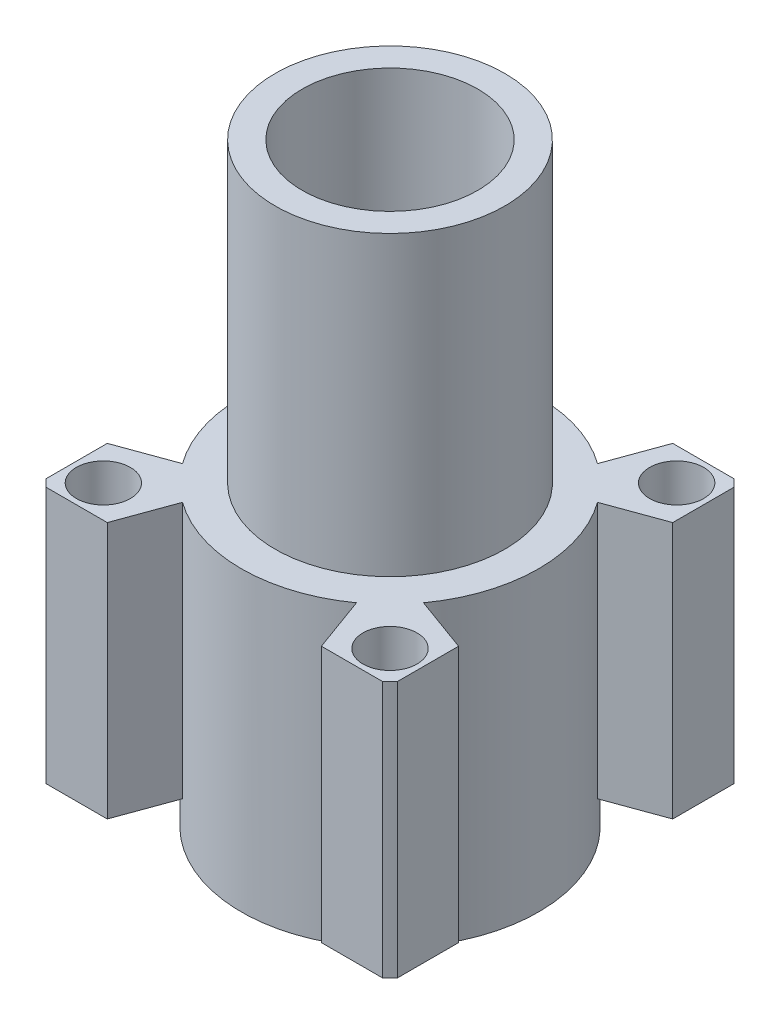
ISO-10303-21;
HEADER;
FILE_DESCRIPTION(('STEP AP214'),'2;1');
FILE_NAME('part.step','',(''),(''),'','','');
FILE_SCHEMA(('AUTOMOTIVE_DESIGN { 1 0 10303 214 1 1 1 1 }'));
ENDSEC;
DATA;
#1=APPLICATION_CONTEXT('core data for automotive mechanical design processes');
#2=APPLICATION_PROTOCOL_DEFINITION('international standard','automotive_design',2000,#1);
#3=PRODUCT_CONTEXT('',#1,'mechanical');
#4=PRODUCT('Part','Part','',(#3));
#5=PRODUCT_RELATED_PRODUCT_CATEGORY('part','',(#4));
#6=PRODUCT_DEFINITION_FORMATION('','',#4);
#7=PRODUCT_DEFINITION_CONTEXT('part definition',#1,'design');
#8=PRODUCT_DEFINITION('design','',#6,#7);
#9=PRODUCT_DEFINITION_SHAPE('','',#8);
#10=(LENGTH_UNIT() NAMED_UNIT(*) SI_UNIT(.MILLI.,.METRE.));
#11=(NAMED_UNIT(*) PLANE_ANGLE_UNIT() SI_UNIT($,.RADIAN.));
#12=(NAMED_UNIT(*) SI_UNIT($,.STERADIAN.) SOLID_ANGLE_UNIT());
#13=UNCERTAINTY_MEASURE_WITH_UNIT(LENGTH_MEASURE(1.E-05),#10,'distance_accuracy_value','');
#14=(GEOMETRIC_REPRESENTATION_CONTEXT(3) GLOBAL_UNCERTAINTY_ASSIGNED_CONTEXT((#13)) GLOBAL_UNIT_ASSIGNED_CONTEXT((#10,
#11,#12)) REPRESENTATION_CONTEXT('',''));
#15=CARTESIAN_POINT('',(0.,0.,0.));
#16=DIRECTION('',(0.,0.,1.));
#17=DIRECTION('',(1.,0.,0.));
#18=AXIS2_PLACEMENT_3D('',#15,#16,#17);
#19=CARTESIAN_POINT('',(-10.,17.,0.));
#20=DIRECTION('',(0.,1.,0.));
#21=DIRECTION('',(0.,0.,1.));
#22=AXIS2_PLACEMENT_3D('',#19,#20,#21);
#23=PLANE('',#22);
#24=CARTESIAN_POINT('',(0.,17.,0.));
#25=DIRECTION('',(0.,-1.,0.));
#26=DIRECTION('',(0.,0.,-1.));
#27=AXIS2_PLACEMENT_3D('',#24,#25,#26);
#28=CIRCLE('',#27,6.5);
#29=CARTESIAN_POINT('',(0.,17.,-6.5));
#30=VERTEX_POINT('',#29);
#31=EDGE_CURVE('E11',#30,#30,#28,.T.);
#32=ORIENTED_EDGE('',*,*,#31,.F.);
#33=EDGE_LOOP('',(#32));
#34=FACE_BOUND('',#33,.T.);
#35=CARTESIAN_POINT('',(0.,17.,0.));
#36=DIRECTION('',(0.,-1.,0.));
#37=DIRECTION('',(0.,0.,-1.));
#38=AXIS2_PLACEMENT_3D('',#35,#36,#37);
#39=CIRCLE('',#38,10.);
#40=CARTESIAN_POINT('',(0.,17.,-10.));
#41=VERTEX_POINT('',#40);
#42=EDGE_CURVE('E384',#41,#41,#39,.T.);
#43=ORIENTED_EDGE('',*,*,#42,.T.);
#44=EDGE_LOOP('',(#43));
#45=FACE_BOUND('',#44,.T.);
#46=ADVANCED_FACE('F31',(#34,#45),#23,.F.);
#47=CARTESIAN_POINT('',(0.,0.,0.));
#48=DIRECTION('',(0.,-1.,0.));
#49=DIRECTION('',(0.,0.,-1.));
#50=AXIS2_PLACEMENT_3D('',#47,#48,#49);
#51=CYLINDRICAL_SURFACE('',#50,6.5);
#52=CARTESIAN_POINT('',(0.,41.,0.));
#53=DIRECTION('',(0.,-1.,0.));
#54=DIRECTION('',(0.,0.,-1.));
#55=AXIS2_PLACEMENT_3D('',#52,#53,#54);
#56=CIRCLE('',#55,6.5);
#57=CARTESIAN_POINT('',(0.,41.,-6.5));
#58=VERTEX_POINT('',#57);
#59=EDGE_CURVE('E38',#58,#58,#56,.T.);
#60=ORIENTED_EDGE('',*,*,#59,.F.);
#61=EDGE_LOOP('',(#60));
#62=FACE_BOUND('',#61,.T.);
#63=ORIENTED_EDGE('',*,*,#31,.T.);
#64=EDGE_LOOP('',(#63));
#65=FACE_BOUND('',#64,.T.);
#66=ADVANCED_FACE('F407',(#62,#65),#51,.F.);
#67=CARTESIAN_POINT('',(-8.5,41.,0.));
#68=DIRECTION('',(0.,-1.,0.));
#69=DIRECTION('',(0.,0.,-1.));
#70=AXIS2_PLACEMENT_3D('',#67,#68,#69);
#71=PLANE('',#70);
#72=CARTESIAN_POINT('',(0.,41.,0.));
#73=DIRECTION('',(0.,-1.,0.));
#74=DIRECTION('',(0.,0.,-1.));
#75=AXIS2_PLACEMENT_3D('',#72,#73,#74);
#76=CIRCLE('',#75,8.5);
#77=CARTESIAN_POINT('',(0.,41.,-8.5));
#78=VERTEX_POINT('',#77);
#79=EDGE_CURVE('E400',#78,#78,#76,.T.);
#80=ORIENTED_EDGE('',*,*,#79,.F.);
#81=EDGE_LOOP('',(#80));
#82=FACE_BOUND('',#81,.T.);
#83=ORIENTED_EDGE('',*,*,#59,.T.);
#84=EDGE_LOOP('',(#83));
#85=FACE_BOUND('',#84,.T.);
#86=ADVANCED_FACE('F405',(#82,#85),#71,.F.);
#87=CARTESIAN_POINT('',(0.,0.,0.));
#88=DIRECTION('',(0.,-1.,0.));
#89=DIRECTION('',(0.,0.,-1.));
#90=AXIS2_PLACEMENT_3D('',#87,#88,#89);
#91=CYLINDRICAL_SURFACE('',#90,8.5);
#92=CARTESIAN_POINT('',(0.,19.,0.));
#93=DIRECTION('',(0.,-1.,0.));
#94=DIRECTION('',(0.,0.,-1.));
#95=AXIS2_PLACEMENT_3D('',#92,#93,#94);
#96=CIRCLE('',#95,8.5);
#97=CARTESIAN_POINT('',(0.,19.,-8.5));
#98=VERTEX_POINT('',#97);
#99=EDGE_CURVE('E397',#98,#98,#96,.T.);
#100=ORIENTED_EDGE('',*,*,#99,.F.);
#101=EDGE_LOOP('',(#100));
#102=FACE_BOUND('',#101,.T.);
#103=ORIENTED_EDGE('',*,*,#79,.T.);
#104=EDGE_LOOP('',(#103));
#105=FACE_BOUND('',#104,.T.);
#106=ADVANCED_FACE('F436',(#102,#105),#91,.T.);
#107=CARTESIAN_POINT('',(-11.,19.,0.));
#108=DIRECTION('',(0.,-1.,0.));
#109=DIRECTION('',(0.,0.,-1.));
#110=AXIS2_PLACEMENT_3D('',#107,#108,#109);
#111=PLANE('',#110);
#112=CARTESIAN_POINT('',(0.,19.,0.));
#113=DIRECTION('',(0.,-1.,0.));
#114=DIRECTION('',(0.,0.,-1.));
#115=AXIS2_PLACEMENT_3D('',#112,#113,#114);
#116=CIRCLE('',#115,11.);
#117=CARTESIAN_POINT('',(8.91871150379086,19.,-6.43867883281566));
#118=VERTEX_POINT('',#117);
#119=CARTESIAN_POINT('',(8.91871150379083,19.,6.4386788328157));
#120=VERTEX_POINT('',#119);
#121=EDGE_CURVE('E396',#118,#120,#116,.T.);
#122=ORIENTED_EDGE('',*,*,#121,.F.);
#123=DIRECTION('',(0.939692620785897,0.,-0.342020143325701));
#124=VECTOR('',#123,1.);
#125=CARTESIAN_POINT('',(8.91871150379086,19.,-6.43867883281566));
#126=LINE('',#125,#124);
#127=CARTESIAN_POINT('',(13.,19.,-7.92414636288902));
#128=VERTEX_POINT('',#127);
#129=EDGE_CURVE('E290',#118,#128,#126,.T.);
#130=ORIENTED_EDGE('',*,*,#129,.T.);
#131=DIRECTION('',(0.,0.,-1.));
#132=VECTOR('',#131,1.);
#133=CARTESIAN_POINT('',(13.,19.,-12.4498995979887));
#134=LINE('',#133,#132);
#135=CARTESIAN_POINT('',(13.,19.,-12.4498995979887));
#136=VERTEX_POINT('',#135);
#137=EDGE_CURVE('E293',#128,#136,#134,.T.);
#138=ORIENTED_EDGE('',*,*,#137,.T.);
#139=CARTESIAN_POINT('',(0.,19.,0.));
#140=DIRECTION('',(0.,1.,0.));
#141=DIRECTION('',(0.,0.,1.));
#142=AXIS2_PLACEMENT_3D('',#139,#140,#141);
#143=CIRCLE('',#142,18.);
#144=CARTESIAN_POINT('',(12.4498995979887,19.,-13.));
#145=VERTEX_POINT('',#144);
#146=EDGE_CURVE('E296',#136,#145,#143,.T.);
#147=ORIENTED_EDGE('',*,*,#146,.T.);
#148=DIRECTION('',(-1.,0.,0.));
#149=VECTOR('',#148,1.);
#150=CARTESIAN_POINT('',(12.4498995979887,19.,-13.));
#151=LINE('',#150,#149);
#152=CARTESIAN_POINT('',(7.92414636288917,19.,-13.));
#153=VERTEX_POINT('',#152);
#154=EDGE_CURVE('E299',#145,#153,#151,.T.);
#155=ORIENTED_EDGE('',*,*,#154,.T.);
#156=DIRECTION('',(-0.342020143325716,0.,0.939692620785891));
#157=VECTOR('',#156,1.);
#158=CARTESIAN_POINT('',(6.43867883281572,19.,-8.91871150379083));
#159=LINE('',#158,#157);
#160=CARTESIAN_POINT('',(6.43867883281571,19.,-8.91871150379083));
#161=VERTEX_POINT('',#160);
#162=EDGE_CURVE('E302',#153,#161,#159,.T.);
#163=ORIENTED_EDGE('',*,*,#162,.T.);
#164=CARTESIAN_POINT('',(-6.43867883281557,19.,-8.91871150379093));
#165=VERTEX_POINT('',#164);
#166=EDGE_CURVE('E393',#165,#161,#116,.T.);
#167=ORIENTED_EDGE('',*,*,#166,.F.);
#168=DIRECTION('',(-0.342020143325701,0.,-0.939692620785897));
#169=VECTOR('',#168,1.);
#170=CARTESIAN_POINT('',(-6.43867883281557,19.,-8.91871150379093));
#171=LINE('',#170,#169);
#172=CARTESIAN_POINT('',(-7.92414636288893,19.,-13.0000000000001));
#173=VERTEX_POINT('',#172);
#174=EDGE_CURVE('E305',#165,#173,#171,.T.);
#175=ORIENTED_EDGE('',*,*,#174,.T.);
#176=DIRECTION('',(-1.,0.,0.));
#177=VECTOR('',#176,1.);
#178=CARTESIAN_POINT('',(-7.92414636288893,19.,-13.0000000000001));
#179=LINE('',#178,#177);
#180=CARTESIAN_POINT('',(-12.4498995979887,19.,-13.));
#181=VERTEX_POINT('',#180);
#182=EDGE_CURVE('E308',#173,#181,#179,.T.);
#183=ORIENTED_EDGE('',*,*,#182,.T.);
#184=CARTESIAN_POINT('',(0.,19.,0.));
#185=DIRECTION('',(0.,1.,0.));
#186=DIRECTION('',(0.,0.,1.));
#187=AXIS2_PLACEMENT_3D('',#184,#185,#186);
#188=CIRCLE('',#187,18.);
#189=CARTESIAN_POINT('',(-13.,19.,-12.4498995979887));
#190=VERTEX_POINT('',#189);
#191=EDGE_CURVE('E311',#181,#190,#188,.T.);
#192=ORIENTED_EDGE('',*,*,#191,.T.);
#193=DIRECTION('',(0.,0.,1.));
#194=VECTOR('',#193,1.);
#195=CARTESIAN_POINT('',(-12.9999999999999,19.,-7.92414636288916));
#196=LINE('',#195,#194);
#197=CARTESIAN_POINT('',(-12.9999999999999,19.,-7.92414636288916));
#198=VERTEX_POINT('',#197);
#199=EDGE_CURVE('E314',#190,#198,#196,.T.);
#200=ORIENTED_EDGE('',*,*,#199,.T.);
#201=DIRECTION('',(0.939692620785891,0.,0.342020143325716));
#202=VECTOR('',#201,1.);
#203=CARTESIAN_POINT('',(-8.91871150379082,19.,-6.43867883281573));
#204=LINE('',#203,#202);
#205=CARTESIAN_POINT('',(-8.91871150379082,19.,-6.43867883281573));
#206=VERTEX_POINT('',#205);
#207=EDGE_CURVE('E317',#198,#206,#204,.T.);
#208=ORIENTED_EDGE('',*,*,#207,.T.);
#209=CARTESIAN_POINT('',(-8.91871150379086,19.,6.43867883281567));
#210=VERTEX_POINT('',#209);
#211=EDGE_CURVE('E395',#210,#206,#116,.T.);
#212=ORIENTED_EDGE('',*,*,#211,.F.);
#213=DIRECTION('',(-0.939692620785897,0.,0.342020143325701));
#214=VECTOR('',#213,1.);
#215=CARTESIAN_POINT('',(-8.91871150379086,19.,6.43867883281567));
#216=LINE('',#215,#214);
#217=CARTESIAN_POINT('',(-13.,19.,7.92414636288902));
#218=VERTEX_POINT('',#217);
#219=EDGE_CURVE('E320',#210,#218,#216,.T.);
#220=ORIENTED_EDGE('',*,*,#219,.T.);
#221=DIRECTION('',(0.,0.,1.));
#222=VECTOR('',#221,1.);
#223=CARTESIAN_POINT('',(-13.,19.,12.4498995979887));
#224=LINE('',#223,#222);
#225=CARTESIAN_POINT('',(-13.,19.,12.4498995979887));
#226=VERTEX_POINT('',#225);
#227=EDGE_CURVE('E323',#218,#226,#224,.T.);
#228=ORIENTED_EDGE('',*,*,#227,.T.);
#229=CARTESIAN_POINT('',(0.,19.,0.));
#230=DIRECTION('',(0.,1.,0.));
#231=DIRECTION('',(0.,0.,1.));
#232=AXIS2_PLACEMENT_3D('',#229,#230,#231);
#233=CIRCLE('',#232,18.);
#234=CARTESIAN_POINT('',(-12.4498995979887,19.,13.));
#235=VERTEX_POINT('',#234);
#236=EDGE_CURVE('E326',#226,#235,#233,.T.);
#237=ORIENTED_EDGE('',*,*,#236,.T.);
#238=DIRECTION('',(1.,0.,0.));
#239=VECTOR('',#238,1.);
#240=CARTESIAN_POINT('',(-12.4498995979887,19.,13.));
#241=LINE('',#240,#239);
#242=CARTESIAN_POINT('',(-7.92414636288916,19.,13.));
#243=VERTEX_POINT('',#242);
#244=EDGE_CURVE('E219',#235,#243,#241,.T.);
#245=ORIENTED_EDGE('',*,*,#244,.T.);
#246=DIRECTION('',(0.342020143325716,0.,-0.939692620785891));
#247=VECTOR('',#246,1.);
#248=CARTESIAN_POINT('',(-6.43867883281572,19.,8.91871150379083));
#249=LINE('',#248,#247);
#250=CARTESIAN_POINT('',(-6.43867883281572,19.,8.91871150379083));
#251=VERTEX_POINT('',#250);
#252=EDGE_CURVE('E216',#243,#251,#249,.T.);
#253=ORIENTED_EDGE('',*,*,#252,.T.);
#254=CARTESIAN_POINT('',(6.43867883281567,19.,8.91871150379086));
#255=VERTEX_POINT('',#254);
#256=EDGE_CURVE('E790',#255,#251,#116,.T.);
#257=ORIENTED_EDGE('',*,*,#256,.F.);
#258=DIRECTION('',(0.342020143325699,0.,0.939692620785897));
#259=VECTOR('',#258,1.);
#260=CARTESIAN_POINT('',(6.43867883281567,19.,8.91871150379086));
#261=LINE('',#260,#259);
#262=CARTESIAN_POINT('',(7.92414636288902,19.,13.));
#263=VERTEX_POINT('',#262);
#264=EDGE_CURVE('E277',#255,#263,#261,.T.);
#265=ORIENTED_EDGE('',*,*,#264,.T.);
#266=DIRECTION('',(1.,0.,0.));
#267=VECTOR('',#266,1.);
#268=CARTESIAN_POINT('',(7.92414636288902,19.,13.));
#269=LINE('',#268,#267);
#270=CARTESIAN_POINT('',(12.4498995979887,19.,13.));
#271=VERTEX_POINT('',#270);
#272=EDGE_CURVE('E196',#263,#271,#269,.T.);
#273=ORIENTED_EDGE('',*,*,#272,.T.);
#274=CARTESIAN_POINT('',(0.,19.,0.));
#275=DIRECTION('',(0.,1.,0.));
#276=DIRECTION('',(0.,0.,1.));
#277=AXIS2_PLACEMENT_3D('',#274,#275,#276);
#278=CIRCLE('',#277,18.);
#279=CARTESIAN_POINT('',(13.,19.,12.4498995979887));
#280=VERTEX_POINT('',#279);
#281=EDGE_CURVE('E281',#271,#280,#278,.T.);
#282=ORIENTED_EDGE('',*,*,#281,.T.);
#283=DIRECTION('',(0.,0.,-1.));
#284=VECTOR('',#283,1.);
#285=CARTESIAN_POINT('',(13.,19.,7.92414636288914));
#286=LINE('',#285,#284);
#287=CARTESIAN_POINT('',(13.,19.,7.92414636288914));
#288=VERTEX_POINT('',#287);
#289=EDGE_CURVE('E284',#280,#288,#286,.T.);
#290=ORIENTED_EDGE('',*,*,#289,.T.);
#291=DIRECTION('',(-0.939692620785891,0.,-0.342020143325716));
#292=VECTOR('',#291,1.);
#293=CARTESIAN_POINT('',(8.91871150379084,19.,6.4386788328157));
#294=LINE('',#293,#292);
#295=EDGE_CURVE('E287',#288,#120,#294,.T.);
#296=ORIENTED_EDGE('',*,*,#295,.T.);
#297=EDGE_LOOP('',(#122,#130,#138,#147,#155,#163,#167,#175,#183,#192,#200,#208,#212,#220,#228,
#237,#245,#253,#257,#265,#273,#282,#290,#296));
#298=FACE_BOUND('',#297,.T.);
#299=CARTESIAN_POINT('',(-10.6066017177982,19.,10.6066017177982));
#300=DIRECTION('',(0.,1.,0.));
#301=DIRECTION('',(0.,0.,-1.));
#302=AXIS2_PLACEMENT_3D('',#299,#300,#301);
#303=CIRCLE('',#302,2.);
#304=CARTESIAN_POINT('',(-10.6066017177982,19.,8.60660171779821));
#305=VERTEX_POINT('',#304);
#306=EDGE_CURVE('E762',#305,#305,#303,.T.);
#307=ORIENTED_EDGE('',*,*,#306,.F.);
#308=EDGE_LOOP('',(#307));
#309=FACE_BOUND('',#308,.T.);
#310=CARTESIAN_POINT('',(-10.6066017177982,19.,-10.6066017177982));
#311=DIRECTION('',(0.,1.,0.));
#312=DIRECTION('',(0.,0.,1.));
#313=AXIS2_PLACEMENT_3D('',#310,#311,#312);
#314=CIRCLE('',#313,2.);
#315=CARTESIAN_POINT('',(-10.6066017177982,19.,-8.60660171779821));
#316=VERTEX_POINT('',#315);
#317=EDGE_CURVE('E768',#316,#316,#314,.T.);
#318=ORIENTED_EDGE('',*,*,#317,.F.);
#319=EDGE_LOOP('',(#318));
#320=FACE_BOUND('',#319,.T.);
#321=CARTESIAN_POINT('',(10.6066017177982,19.,-10.6066017177982));
#322=DIRECTION('',(0.,1.,0.));
#323=DIRECTION('',(0.,0.,-1.));
#324=AXIS2_PLACEMENT_3D('',#321,#322,#323);
#325=CIRCLE('',#324,2.);
#326=CARTESIAN_POINT('',(10.6066017177982,19.,-12.6066017177982));
#327=VERTEX_POINT('',#326);
#328=EDGE_CURVE('E222',#327,#327,#325,.T.);
#329=ORIENTED_EDGE('',*,*,#328,.F.);
#330=EDGE_LOOP('',(#329));
#331=FACE_BOUND('',#330,.T.);
#332=CARTESIAN_POINT('',(10.6066017177982,19.,10.6066017177982));
#333=DIRECTION('',(0.,1.,0.));
#334=DIRECTION('',(0.,0.,1.));
#335=AXIS2_PLACEMENT_3D('',#332,#333,#334);
#336=CIRCLE('',#335,2.);
#337=CARTESIAN_POINT('',(10.6066017177982,19.,12.6066017177982));
#338=VERTEX_POINT('',#337);
#339=EDGE_CURVE('E759',#338,#338,#336,.T.);
#340=ORIENTED_EDGE('',*,*,#339,.F.);
#341=EDGE_LOOP('',(#340));
#342=FACE_BOUND('',#341,.T.);
#343=ORIENTED_EDGE('',*,*,#99,.T.);
#344=EDGE_LOOP('',(#343));
#345=FACE_BOUND('',#344,.T.);
#346=ADVANCED_FACE('F431',(#298,#309,#320,#331,#342,#345),#111,.F.);
#347=CARTESIAN_POINT('',(0.,0.,0.));
#348=DIRECTION('',(0.,-1.,0.));
#349=DIRECTION('',(0.,0.,-1.));
#350=AXIS2_PLACEMENT_3D('',#347,#348,#349);
#351=CYLINDRICAL_SURFACE('',#350,11.);
#352=DIRECTION('',(0.,1.,0.));
#353=VECTOR('',#352,1.);
#354=CARTESIAN_POINT('',(8.91871150379083,0.,6.4386788328157));
#355=LINE('',#354,#353);
#356=CARTESIAN_POINT('',(8.91871150379083,0.,6.4386788328157));
#357=VERTEX_POINT('',#356);
#358=EDGE_CURVE('E45',#357,#120,#355,.T.);
#359=ORIENTED_EDGE('',*,*,#358,.F.);
#360=CARTESIAN_POINT('',(0.,0.,0.));
#361=DIRECTION('',(0.,1.,0.));
#362=DIRECTION('',(0.,0.,1.));
#363=AXIS2_PLACEMENT_3D('',#360,#361,#362);
#364=CIRCLE('',#363,11.);
#365=CARTESIAN_POINT('',(6.43867883281567,0.,8.91871150379086));
#366=VERTEX_POINT('',#365);
#367=EDGE_CURVE('E383',#366,#357,#364,.T.);
#368=ORIENTED_EDGE('',*,*,#367,.F.);
#369=DIRECTION('',(0.,1.,0.));
#370=VECTOR('',#369,1.);
#371=CARTESIAN_POINT('',(6.43867883281567,0.,8.91871150379086));
#372=LINE('',#371,#370);
#373=EDGE_CURVE('E202',#366,#255,#372,.T.);
#374=ORIENTED_EDGE('',*,*,#373,.T.);
#375=ORIENTED_EDGE('',*,*,#256,.T.);
#376=DIRECTION('',(0.,1.,0.));
#377=VECTOR('',#376,1.);
#378=CARTESIAN_POINT('',(-6.43867883281572,0.,8.91871150379083));
#379=LINE('',#378,#377);
#380=CARTESIAN_POINT('',(-6.43867883281572,0.,8.91871150379083));
#381=VERTEX_POINT('',#380);
#382=EDGE_CURVE('E331',#381,#251,#379,.T.);
#383=ORIENTED_EDGE('',*,*,#382,.F.);
#384=CARTESIAN_POINT('',(-8.91871150379086,0.,6.43867883281567));
#385=VERTEX_POINT('',#384);
#386=EDGE_CURVE('E334',#385,#381,#364,.T.);
#387=ORIENTED_EDGE('',*,*,#386,.F.);
#388=DIRECTION('',(0.,1.,0.));
#389=VECTOR('',#388,1.);
#390=CARTESIAN_POINT('',(-8.91871150379086,0.,6.43867883281567));
#391=LINE('',#390,#389);
#392=EDGE_CURVE('E343',#385,#210,#391,.T.);
#393=ORIENTED_EDGE('',*,*,#392,.T.);
#394=ORIENTED_EDGE('',*,*,#211,.T.);
#395=DIRECTION('',(0.,1.,0.));
#396=VECTOR('',#395,1.);
#397=CARTESIAN_POINT('',(-8.91871150379081,0.,-6.43867883281573));
#398=LINE('',#397,#396);
#399=CARTESIAN_POINT('',(-8.91871150379081,0.,-6.43867883281573));
#400=VERTEX_POINT('',#399);
#401=EDGE_CURVE('E346',#400,#206,#398,.T.);
#402=ORIENTED_EDGE('',*,*,#401,.F.);
#403=CARTESIAN_POINT('',(-6.43867883281557,0.,-8.91871150379093));
#404=VERTEX_POINT('',#403);
#405=EDGE_CURVE('E382',#404,#400,#364,.T.);
#406=ORIENTED_EDGE('',*,*,#405,.F.);
#407=DIRECTION('',(0.,1.,0.));
#408=VECTOR('',#407,1.);
#409=CARTESIAN_POINT('',(-6.43867883281557,0.,-8.91871150379093));
#410=LINE('',#409,#408);
#411=EDGE_CURVE('E357',#404,#165,#410,.T.);
#412=ORIENTED_EDGE('',*,*,#411,.T.);
#413=ORIENTED_EDGE('',*,*,#166,.T.);
#414=DIRECTION('',(0.,1.,0.));
#415=VECTOR('',#414,1.);
#416=CARTESIAN_POINT('',(6.43867883281571,0.,-8.91871150379083));
#417=LINE('',#416,#415);
#418=CARTESIAN_POINT('',(6.43867883281571,0.,-8.91871150379083));
#419=VERTEX_POINT('',#418);
#420=EDGE_CURVE('E360',#419,#161,#417,.T.);
#421=ORIENTED_EDGE('',*,*,#420,.F.);
#422=CARTESIAN_POINT('',(8.91871150379087,0.,-6.43867883281566));
#423=VERTEX_POINT('',#422);
#424=EDGE_CURVE('E52',#423,#419,#364,.T.);
#425=ORIENTED_EDGE('',*,*,#424,.F.);
#426=DIRECTION('',(0.,1.,0.));
#427=VECTOR('',#426,1.);
#428=CARTESIAN_POINT('',(8.91871150379086,0.,-6.43867883281566));
#429=LINE('',#428,#427);
#430=EDGE_CURVE('E371',#423,#118,#429,.T.);
#431=ORIENTED_EDGE('',*,*,#430,.T.);
#432=ORIENTED_EDGE('',*,*,#121,.T.);
#433=EDGE_LOOP('',(#359,#368,#374,#375,#383,#387,#393,#394,#402,#406,#412,#413,#421,#425,#431,#432));
#434=FACE_BOUND('',#433,.T.);
#435=CARTESIAN_POINT('',(0.,-3.,0.));
#436=DIRECTION('',(0.,-1.,0.));
#437=DIRECTION('',(0.,0.,-1.));
#438=AXIS2_PLACEMENT_3D('',#435,#436,#437);
#439=CIRCLE('',#438,11.);
#440=CARTESIAN_POINT('',(0.,-3.,-11.));
#441=VERTEX_POINT('',#440);
#442=EDGE_CURVE('E390',#441,#441,#439,.T.);
#443=ORIENTED_EDGE('',*,*,#442,.F.);
#444=EDGE_LOOP('',(#443));
#445=FACE_BOUND('',#444,.T.);
#446=ADVANCED_FACE('F426',(#434,#445),#351,.T.);
#447=CARTESIAN_POINT('',(-11.,-3.,0.));
#448=DIRECTION('',(0.,1.,0.));
#449=DIRECTION('',(0.,0.,1.));
#450=AXIS2_PLACEMENT_3D('',#447,#448,#449);
#451=PLANE('',#450);
#452=CARTESIAN_POINT('',(0.,-3.,0.));
#453=DIRECTION('',(0.,-1.,0.));
#454=DIRECTION('',(0.,0.,-1.));
#455=AXIS2_PLACEMENT_3D('',#452,#453,#454);
#456=CIRCLE('',#455,10.);
#457=CARTESIAN_POINT('',(0.,-3.,-10.));
#458=VERTEX_POINT('',#457);
#459=EDGE_CURVE('E387',#458,#458,#456,.T.);
#460=ORIENTED_EDGE('',*,*,#459,.F.);
#461=EDGE_LOOP('',(#460));
#462=FACE_BOUND('',#461,.T.);
#463=ORIENTED_EDGE('',*,*,#442,.T.);
#464=EDGE_LOOP('',(#463));
#465=FACE_BOUND('',#464,.T.);
#466=ADVANCED_FACE('F420',(#462,#465),#451,.F.);
#467=CARTESIAN_POINT('',(0.,0.,0.));
#468=DIRECTION('',(0.,-1.,0.));
#469=DIRECTION('',(0.,0.,-1.));
#470=AXIS2_PLACEMENT_3D('',#467,#468,#469);
#471=CYLINDRICAL_SURFACE('',#470,10.);
#472=ORIENTED_EDGE('',*,*,#42,.F.);
#473=EDGE_LOOP('',(#472));
#474=FACE_BOUND('',#473,.T.);
#475=ORIENTED_EDGE('',*,*,#459,.T.);
#476=EDGE_LOOP('',(#475));
#477=FACE_BOUND('',#476,.T.);
#478=ADVANCED_FACE('F416',(#474,#477),#471,.F.);
#479=CARTESIAN_POINT('',(-12.4498995979887,0.,13.));
#480=DIRECTION('',(0.,0.,1.));
#481=DIRECTION('',(1.,0.,0.));
#482=AXIS2_PLACEMENT_3D('',#479,#480,#481);
#483=PLANE('',#482);
#484=ORIENTED_EDGE('',*,*,#244,.F.);
#485=DIRECTION('',(0.,1.,0.));
#486=VECTOR('',#485,1.);
#487=CARTESIAN_POINT('',(-12.4498995979887,0.,13.));
#488=LINE('',#487,#486);
#489=CARTESIAN_POINT('',(-12.4498995979887,0.,13.));
#490=VERTEX_POINT('',#489);
#491=EDGE_CURVE('E337',#490,#235,#488,.T.);
#492=ORIENTED_EDGE('',*,*,#491,.F.);
#493=DIRECTION('',(1.,0.,0.));
#494=VECTOR('',#493,1.);
#495=CARTESIAN_POINT('',(-12.4498995979887,0.,13.));
#496=LINE('',#495,#494);
#497=CARTESIAN_POINT('',(-7.92414636288916,0.,13.));
#498=VERTEX_POINT('',#497);
#499=EDGE_CURVE('E271',#490,#498,#496,.T.);
#500=ORIENTED_EDGE('',*,*,#499,.T.);
#501=DIRECTION('',(0.,1.,0.));
#502=VECTOR('',#501,1.);
#503=CARTESIAN_POINT('',(-7.92414636288916,0.,13.));
#504=LINE('',#503,#502);
#505=EDGE_CURVE('E335',#498,#243,#504,.T.);
#506=ORIENTED_EDGE('',*,*,#505,.T.);
#507=EDGE_LOOP('',(#484,#492,#500,#506));
#508=FACE_BOUND('',#507,.T.);
#509=ADVANCED_FACE('F419',(#508),#483,.T.);
#510=CARTESIAN_POINT('',(0.,0.,0.));
#511=DIRECTION('',(0.,1.,0.));
#512=DIRECTION('',(0.,0.,1.));
#513=AXIS2_PLACEMENT_3D('',#510,#511,#512);
#514=CYLINDRICAL_SURFACE('',#513,18.);
#515=ORIENTED_EDGE('',*,*,#236,.F.);
#516=DIRECTION('',(0.,1.,0.));
#517=VECTOR('',#516,1.);
#518=CARTESIAN_POINT('',(-13.,0.,12.4498995979887));
#519=LINE('',#518,#517);
#520=CARTESIAN_POINT('',(-13.,0.,12.4498995979887));
#521=VERTEX_POINT('',#520);
#522=EDGE_CURVE('E339',#521,#226,#519,.T.);
#523=ORIENTED_EDGE('',*,*,#522,.F.);
#524=CARTESIAN_POINT('',(0.,0.,0.));
#525=DIRECTION('',(0.,1.,0.));
#526=DIRECTION('',(0.,0.,1.));
#527=AXIS2_PLACEMENT_3D('',#524,#525,#526);
#528=CIRCLE('',#527,18.);
#529=EDGE_CURVE('E268',#521,#490,#528,.T.);
#530=ORIENTED_EDGE('',*,*,#529,.T.);
#531=ORIENTED_EDGE('',*,*,#491,.T.);
#532=EDGE_LOOP('',(#515,#523,#530,#531));
#533=FACE_BOUND('',#532,.T.);
#534=ADVANCED_FACE('F483',(#533),#514,.T.);
#535=CARTESIAN_POINT('',(-13.,0.,12.4498995979887));
#536=DIRECTION('',(-1.,0.,0.));
#537=DIRECTION('',(0.,0.,1.));
#538=AXIS2_PLACEMENT_3D('',#535,#536,#537);
#539=PLANE('',#538);
#540=ORIENTED_EDGE('',*,*,#227,.F.);
#541=DIRECTION('',(0.,1.,0.));
#542=VECTOR('',#541,1.);
#543=CARTESIAN_POINT('',(-13.,0.,7.92414636288902));
#544=LINE('',#543,#542);
#545=CARTESIAN_POINT('',(-13.,0.,7.92414636288902));
#546=VERTEX_POINT('',#545);
#547=EDGE_CURVE('E341',#546,#218,#544,.T.);
#548=ORIENTED_EDGE('',*,*,#547,.F.);
#549=DIRECTION('',(0.,0.,1.));
#550=VECTOR('',#549,1.);
#551=CARTESIAN_POINT('',(-13.,0.,12.4498995979887));
#552=LINE('',#551,#550);
#553=EDGE_CURVE('E265',#546,#521,#552,.T.);
#554=ORIENTED_EDGE('',*,*,#553,.T.);
#555=ORIENTED_EDGE('',*,*,#522,.T.);
#556=EDGE_LOOP('',(#540,#548,#554,#555));
#557=FACE_BOUND('',#556,.T.);
#558=ADVANCED_FACE('F493',(#557),#539,.T.);
#559=CARTESIAN_POINT('',(-10.6066017177982,0.,10.6066017177982));
#560=DIRECTION('',(0.,1.,0.));
#561=DIRECTION('',(0.,0.,1.));
#562=AXIS2_PLACEMENT_3D('',#559,#560,#561);
#563=CYLINDRICAL_SURFACE('',#562,2.);
#564=CARTESIAN_POINT('',(-10.6066017177982,0.,10.6066017177982));
#565=DIRECTION('',(0.,1.,0.));
#566=DIRECTION('',(0.,0.,-1.));
#567=AXIS2_PLACEMENT_3D('',#564,#565,#566);
#568=CIRCLE('',#567,2.);
#569=CARTESIAN_POINT('',(-10.6066017177982,0.,8.60660171779821));
#570=VERTEX_POINT('',#569);
#571=EDGE_CURVE('E765',#570,#570,#568,.T.);
#572=ORIENTED_EDGE('',*,*,#571,.F.);
#573=EDGE_LOOP('',(#572));
#574=FACE_BOUND('',#573,.T.);
#575=ORIENTED_EDGE('',*,*,#306,.T.);
#576=EDGE_LOOP('',(#575));
#577=FACE_BOUND('',#576,.T.);
#578=ADVANCED_FACE('F503',(#574,#577),#563,.F.);
#579=CARTESIAN_POINT('',(0.,0.,0.));
#580=DIRECTION('',(0.,1.,0.));
#581=DIRECTION('',(0.,0.,1.));
#582=AXIS2_PLACEMENT_3D('',#579,#580,#581);
#583=PLANE('',#582);
#584=ORIENTED_EDGE('',*,*,#571,.T.);
#585=EDGE_LOOP('',(#584));
#586=FACE_BOUND('',#585,.T.);
#587=DIRECTION('',(-0.939692620785897,0.,0.342020143325701));
#588=VECTOR('',#587,1.);
#589=CARTESIAN_POINT('',(-8.91871150379086,0.,6.43867883281567));
#590=LINE('',#589,#588);
#591=EDGE_CURVE('E262',#385,#546,#590,.T.);
#592=ORIENTED_EDGE('',*,*,#591,.F.);
#593=ORIENTED_EDGE('',*,*,#386,.T.);
#594=DIRECTION('',(0.342020143325716,0.,-0.939692620785891));
#595=VECTOR('',#594,1.);
#596=CARTESIAN_POINT('',(-6.43867883281572,0.,8.91871150379083));
#597=LINE('',#596,#595);
#598=EDGE_CURVE('E274',#498,#381,#597,.T.);
#599=ORIENTED_EDGE('',*,*,#598,.F.);
#600=ORIENTED_EDGE('',*,*,#499,.F.);
#601=ORIENTED_EDGE('',*,*,#529,.F.);
#602=ORIENTED_EDGE('',*,*,#553,.F.);
#603=EDGE_LOOP('',(#592,#593,#599,#600,#601,#602));
#604=FACE_BOUND('',#603,.T.);
#605=ADVANCED_FACE('F513',(#586,#604),#583,.F.);
#606=CARTESIAN_POINT('',(-8.91871150379086,0.,6.43867883281567));
#607=DIRECTION('',(-0.3420201433257,0.,-0.939692620785897));
#608=DIRECTION('',(-0.939692620785897,0.,0.342020143325701));
#609=AXIS2_PLACEMENT_3D('',#606,#607,#608);
#610=PLANE('',#609);
#611=ORIENTED_EDGE('',*,*,#219,.F.);
#612=ORIENTED_EDGE('',*,*,#392,.F.);
#613=ORIENTED_EDGE('',*,*,#591,.T.);
#614=ORIENTED_EDGE('',*,*,#547,.T.);
#615=EDGE_LOOP('',(#611,#612,#613,#614));
#616=FACE_BOUND('',#615,.T.);
#617=ADVANCED_FACE('F524',(#616),#610,.T.);
#618=CARTESIAN_POINT('',(-6.43867883281572,0.,8.91871150379083));
#619=DIRECTION('',(0.939692620785891,0.,0.342020143325716));
#620=DIRECTION('',(0.342020143325716,0.,-0.939692620785891));
#621=AXIS2_PLACEMENT_3D('',#618,#619,#620);
#622=PLANE('',#621);
#623=ORIENTED_EDGE('',*,*,#252,.F.);
#624=ORIENTED_EDGE('',*,*,#505,.F.);
#625=ORIENTED_EDGE('',*,*,#598,.T.);
#626=ORIENTED_EDGE('',*,*,#382,.T.);
#627=EDGE_LOOP('',(#623,#624,#625,#626));
#628=FACE_BOUND('',#627,.T.);
#629=ADVANCED_FACE('F535',(#628),#622,.T.);
#630=CARTESIAN_POINT('',(-12.9999999999999,0.,-7.92414636288916));
#631=DIRECTION('',(-1.,0.,0.));
#632=DIRECTION('',(0.,0.,1.));
#633=AXIS2_PLACEMENT_3D('',#630,#631,#632);
#634=PLANE('',#633);
#635=ORIENTED_EDGE('',*,*,#199,.F.);
#636=DIRECTION('',(0.,1.,0.));
#637=VECTOR('',#636,1.);
#638=CARTESIAN_POINT('',(-13.,0.,-12.4498995979887));
#639=LINE('',#638,#637);
#640=CARTESIAN_POINT('',(-13.,0.,-12.4498995979887));
#641=VERTEX_POINT('',#640);
#642=EDGE_CURVE('E351',#641,#190,#639,.T.);
#643=ORIENTED_EDGE('',*,*,#642,.F.);
#644=DIRECTION('',(0.,0.,1.));
#645=VECTOR('',#644,1.);
#646=CARTESIAN_POINT('',(-12.9999999999999,0.,-7.92414636288916));
#647=LINE('',#646,#645);
#648=CARTESIAN_POINT('',(-12.9999999999999,0.,-7.92414636288916));
#649=VERTEX_POINT('',#648);
#650=EDGE_CURVE('E256',#641,#649,#647,.T.);
#651=ORIENTED_EDGE('',*,*,#650,.T.);
#652=DIRECTION('',(0.,1.,0.));
#653=VECTOR('',#652,1.);
#654=CARTESIAN_POINT('',(-12.9999999999999,0.,-7.92414636288916));
#655=LINE('',#654,#653);
#656=EDGE_CURVE('E349',#649,#198,#655,.T.);
#657=ORIENTED_EDGE('',*,*,#656,.T.);
#658=EDGE_LOOP('',(#635,#643,#651,#657));
#659=FACE_BOUND('',#658,.T.);
#660=ADVANCED_FACE('F545',(#659),#634,.T.);
#661=CARTESIAN_POINT('',(0.,0.,0.));
#662=DIRECTION('',(0.,1.,0.));
#663=DIRECTION('',(0.,0.,1.));
#664=AXIS2_PLACEMENT_3D('',#661,#662,#663);
#665=CYLINDRICAL_SURFACE('',#664,18.);
#666=ORIENTED_EDGE('',*,*,#191,.F.);
#667=DIRECTION('',(0.,1.,0.));
#668=VECTOR('',#667,1.);
#669=CARTESIAN_POINT('',(-12.4498995979887,0.,-13.));
#670=LINE('',#669,#668);
#671=CARTESIAN_POINT('',(-12.4498995979887,0.,-13.));
#672=VERTEX_POINT('',#671);
#673=EDGE_CURVE('E353',#672,#181,#670,.T.);
#674=ORIENTED_EDGE('',*,*,#673,.F.);
#675=CARTESIAN_POINT('',(0.,0.,0.));
#676=DIRECTION('',(0.,1.,0.));
#677=DIRECTION('',(0.,0.,1.));
#678=AXIS2_PLACEMENT_3D('',#675,#676,#677);
#679=CIRCLE('',#678,18.);
#680=EDGE_CURVE('E253',#672,#641,#679,.T.);
#681=ORIENTED_EDGE('',*,*,#680,.T.);
#682=ORIENTED_EDGE('',*,*,#642,.T.);
#683=EDGE_LOOP('',(#666,#674,#681,#682));
#684=FACE_BOUND('',#683,.T.);
#685=ADVANCED_FACE('F555',(#684),#665,.T.);
#686=CARTESIAN_POINT('',(-7.92414636288893,0.,-13.0000000000001));
#687=DIRECTION('',(0.,0.,-1.));
#688=DIRECTION('',(-1.,0.,0.));
#689=AXIS2_PLACEMENT_3D('',#686,#687,#688);
#690=PLANE('',#689);
#691=ORIENTED_EDGE('',*,*,#182,.F.);
#692=DIRECTION('',(0.,1.,0.));
#693=VECTOR('',#692,1.);
#694=CARTESIAN_POINT('',(-7.92414636288893,0.,-13.0000000000001));
#695=LINE('',#694,#693);
#696=CARTESIAN_POINT('',(-7.92414636288893,0.,-13.0000000000001));
#697=VERTEX_POINT('',#696);
#698=EDGE_CURVE('E355',#697,#173,#695,.T.);
#699=ORIENTED_EDGE('',*,*,#698,.F.);
#700=DIRECTION('',(-1.,0.,0.));
#701=VECTOR('',#700,1.);
#702=CARTESIAN_POINT('',(-7.92414636288893,0.,-13.0000000000001));
#703=LINE('',#702,#701);
#704=EDGE_CURVE('E250',#697,#672,#703,.T.);
#705=ORIENTED_EDGE('',*,*,#704,.T.);
#706=ORIENTED_EDGE('',*,*,#673,.T.);
#707=EDGE_LOOP('',(#691,#699,#705,#706));
#708=FACE_BOUND('',#707,.T.);
#709=ADVANCED_FACE('F565',(#708),#690,.T.);
#710=CARTESIAN_POINT('',(-10.6066017177982,0.,-10.6066017177982));
#711=DIRECTION('',(0.,1.,0.));
#712=DIRECTION('',(0.,0.,1.));
#713=AXIS2_PLACEMENT_3D('',#710,#711,#712);
#714=CYLINDRICAL_SURFACE('',#713,2.);
#715=CARTESIAN_POINT('',(-10.6066017177982,0.,-10.6066017177982));
#716=DIRECTION('',(0.,1.,0.));
#717=DIRECTION('',(0.,0.,1.));
#718=AXIS2_PLACEMENT_3D('',#715,#716,#717);
#719=CIRCLE('',#718,2.);
#720=CARTESIAN_POINT('',(-10.6066017177982,0.,-8.60660171779821));
#721=VERTEX_POINT('',#720);
#722=EDGE_CURVE('E771',#721,#721,#719,.T.);
#723=ORIENTED_EDGE('',*,*,#722,.F.);
#724=EDGE_LOOP('',(#723));
#725=FACE_BOUND('',#724,.T.);
#726=ORIENTED_EDGE('',*,*,#317,.T.);
#727=EDGE_LOOP('',(#726));
#728=FACE_BOUND('',#727,.T.);
#729=ADVANCED_FACE('F575',(#725,#728),#714,.F.);
#730=ORIENTED_EDGE('',*,*,#722,.T.);
#731=EDGE_LOOP('',(#730));
#732=FACE_BOUND('',#731,.T.);
#733=DIRECTION('',(-0.342020143325701,0.,-0.939692620785897));
#734=VECTOR('',#733,1.);
#735=CARTESIAN_POINT('',(-6.43867883281557,0.,-8.91871150379093));
#736=LINE('',#735,#734);
#737=EDGE_CURVE('E247',#404,#697,#736,.T.);
#738=ORIENTED_EDGE('',*,*,#737,.F.);
#739=ORIENTED_EDGE('',*,*,#405,.T.);
#740=DIRECTION('',(0.939692620785891,0.,0.342020143325716));
#741=VECTOR('',#740,1.);
#742=CARTESIAN_POINT('',(-8.91871150379082,0.,-6.43867883281573));
#743=LINE('',#742,#741);
#744=EDGE_CURVE('E259',#649,#400,#743,.T.);
#745=ORIENTED_EDGE('',*,*,#744,.F.);
#746=ORIENTED_EDGE('',*,*,#650,.F.);
#747=ORIENTED_EDGE('',*,*,#680,.F.);
#748=ORIENTED_EDGE('',*,*,#704,.F.);
#749=EDGE_LOOP('',(#738,#739,#745,#746,#747,#748));
#750=FACE_BOUND('',#749,.T.);
#751=ADVANCED_FACE('F527',(#732,#750),#583,.F.);
#752=CARTESIAN_POINT('',(-6.43867883281557,0.,-8.91871150379093));
#753=DIRECTION('',(0.939692620785897,0.,-0.342020143325701));
#754=DIRECTION('',(-0.342020143325701,0.,-0.939692620785897));
#755=AXIS2_PLACEMENT_3D('',#752,#753,#754);
#756=PLANE('',#755);
#757=ORIENTED_EDGE('',*,*,#174,.F.);
#758=ORIENTED_EDGE('',*,*,#411,.F.);
#759=ORIENTED_EDGE('',*,*,#737,.T.);
#760=ORIENTED_EDGE('',*,*,#698,.T.);
#761=EDGE_LOOP('',(#757,#758,#759,#760));
#762=FACE_BOUND('',#761,.T.);
#763=ADVANCED_FACE('F595',(#762),#756,.T.);
#764=CARTESIAN_POINT('',(-8.91871150379082,0.,-6.43867883281573));
#765=DIRECTION('',(-0.342020143325716,0.,0.939692620785891));
#766=DIRECTION('',(0.939692620785891,0.,0.342020143325716));
#767=AXIS2_PLACEMENT_3D('',#764,#765,#766);
#768=PLANE('',#767);
#769=ORIENTED_EDGE('',*,*,#207,.F.);
#770=ORIENTED_EDGE('',*,*,#656,.F.);
#771=ORIENTED_EDGE('',*,*,#744,.T.);
#772=ORIENTED_EDGE('',*,*,#401,.T.);
#773=EDGE_LOOP('',(#769,#770,#771,#772));
#774=FACE_BOUND('',#773,.T.);
#775=ADVANCED_FACE('F605',(#774),#768,.T.);
#776=CARTESIAN_POINT('',(12.4498995979887,0.,-13.));
#777=DIRECTION('',(0.,0.,-1.));
#778=DIRECTION('',(-1.,0.,0.));
#779=AXIS2_PLACEMENT_3D('',#776,#777,#778);
#780=PLANE('',#779);
#781=ORIENTED_EDGE('',*,*,#154,.F.);
#782=DIRECTION('',(0.,1.,0.));
#783=VECTOR('',#782,1.);
#784=CARTESIAN_POINT('',(12.4498995979887,0.,-13.));
#785=LINE('',#784,#783);
#786=CARTESIAN_POINT('',(12.4498995979887,0.,-13.));
#787=VERTEX_POINT('',#786);
#788=EDGE_CURVE('E365',#787,#145,#785,.T.);
#789=ORIENTED_EDGE('',*,*,#788,.F.);
#790=DIRECTION('',(-1.,0.,0.));
#791=VECTOR('',#790,1.);
#792=CARTESIAN_POINT('',(12.4498995979887,0.,-13.));
#793=LINE('',#792,#791);
#794=CARTESIAN_POINT('',(7.92414636288917,0.,-13.));
#795=VERTEX_POINT('',#794);
#796=EDGE_CURVE('E241',#787,#795,#793,.T.);
#797=ORIENTED_EDGE('',*,*,#796,.T.);
#798=DIRECTION('',(0.,1.,0.));
#799=VECTOR('',#798,1.);
#800=CARTESIAN_POINT('',(7.92414636288917,0.,-13.));
#801=LINE('',#800,#799);
#802=EDGE_CURVE('E363',#795,#153,#801,.T.);
#803=ORIENTED_EDGE('',*,*,#802,.T.);
#804=EDGE_LOOP('',(#781,#789,#797,#803));
#805=FACE_BOUND('',#804,.T.);
#806=ADVANCED_FACE('F615',(#805),#780,.T.);
#807=CARTESIAN_POINT('',(0.,0.,0.));
#808=DIRECTION('',(0.,1.,0.));
#809=DIRECTION('',(0.,0.,1.));
#810=AXIS2_PLACEMENT_3D('',#807,#808,#809);
#811=CYLINDRICAL_SURFACE('',#810,18.);
#812=ORIENTED_EDGE('',*,*,#146,.F.);
#813=DIRECTION('',(0.,1.,0.));
#814=VECTOR('',#813,1.);
#815=CARTESIAN_POINT('',(13.,0.,-12.4498995979887));
#816=LINE('',#815,#814);
#817=CARTESIAN_POINT('',(13.,0.,-12.4498995979887));
#818=VERTEX_POINT('',#817);
#819=EDGE_CURVE('E367',#818,#136,#816,.T.);
#820=ORIENTED_EDGE('',*,*,#819,.F.);
#821=CARTESIAN_POINT('',(0.,0.,0.));
#822=DIRECTION('',(0.,1.,0.));
#823=DIRECTION('',(0.,0.,1.));
#824=AXIS2_PLACEMENT_3D('',#821,#822,#823);
#825=CIRCLE('',#824,18.);
#826=EDGE_CURVE('E238',#818,#787,#825,.T.);
#827=ORIENTED_EDGE('',*,*,#826,.T.);
#828=ORIENTED_EDGE('',*,*,#788,.T.);
#829=EDGE_LOOP('',(#812,#820,#827,#828));
#830=FACE_BOUND('',#829,.T.);
#831=ADVANCED_FACE('F625',(#830),#811,.T.);
#832=CARTESIAN_POINT('',(13.,0.,-12.4498995979887));
#833=DIRECTION('',(1.,0.,0.));
#834=DIRECTION('',(0.,0.,-1.));
#835=AXIS2_PLACEMENT_3D('',#832,#833,#834);
#836=PLANE('',#835);
#837=ORIENTED_EDGE('',*,*,#137,.F.);
#838=DIRECTION('',(0.,1.,0.));
#839=VECTOR('',#838,1.);
#840=CARTESIAN_POINT('',(13.,0.,-7.92414636288902));
#841=LINE('',#840,#839);
#842=CARTESIAN_POINT('',(13.,0.,-7.92414636288902));
#843=VERTEX_POINT('',#842);
#844=EDGE_CURVE('E369',#843,#128,#841,.T.);
#845=ORIENTED_EDGE('',*,*,#844,.F.);
#846=DIRECTION('',(0.,0.,-1.));
#847=VECTOR('',#846,1.);
#848=CARTESIAN_POINT('',(13.,0.,-12.4498995979887));
#849=LINE('',#848,#847);
#850=EDGE_CURVE('E235',#843,#818,#849,.T.);
#851=ORIENTED_EDGE('',*,*,#850,.T.);
#852=ORIENTED_EDGE('',*,*,#819,.T.);
#853=EDGE_LOOP('',(#837,#845,#851,#852));
#854=FACE_BOUND('',#853,.T.);
#855=ADVANCED_FACE('F635',(#854),#836,.T.);
#856=CARTESIAN_POINT('',(10.6066017177982,0.,-10.6066017177982));
#857=DIRECTION('',(0.,1.,0.));
#858=DIRECTION('',(0.,0.,1.));
#859=AXIS2_PLACEMENT_3D('',#856,#857,#858);
#860=CYLINDRICAL_SURFACE('',#859,2.);
#861=CARTESIAN_POINT('',(10.6066017177982,0.,-10.6066017177982));
#862=DIRECTION('',(0.,1.,0.));
#863=DIRECTION('',(0.,0.,-1.));
#864=AXIS2_PLACEMENT_3D('',#861,#862,#863);
#865=CIRCLE('',#864,2.);
#866=CARTESIAN_POINT('',(10.6066017177982,0.,-12.6066017177982));
#867=VERTEX_POINT('',#866);
#868=EDGE_CURVE('E279',#867,#867,#865,.T.);
#869=ORIENTED_EDGE('',*,*,#868,.F.);
#870=EDGE_LOOP('',(#869));
#871=FACE_BOUND('',#870,.T.);
#872=ORIENTED_EDGE('',*,*,#328,.T.);
#873=EDGE_LOOP('',(#872));
#874=FACE_BOUND('',#873,.T.);
#875=ADVANCED_FACE('F645',(#871,#874),#860,.F.);
#876=ORIENTED_EDGE('',*,*,#868,.T.);
#877=EDGE_LOOP('',(#876));
#878=FACE_BOUND('',#877,.T.);
#879=DIRECTION('',(0.939692620785897,0.,-0.342020143325701));
#880=VECTOR('',#879,1.);
#881=CARTESIAN_POINT('',(8.91871150379086,0.,-6.43867883281566));
#882=LINE('',#881,#880);
#883=EDGE_CURVE('E232',#423,#843,#882,.T.);
#884=ORIENTED_EDGE('',*,*,#883,.F.);
#885=ORIENTED_EDGE('',*,*,#424,.T.);
#886=DIRECTION('',(-0.342020143325716,0.,0.939692620785891));
#887=VECTOR('',#886,1.);
#888=CARTESIAN_POINT('',(6.43867883281572,0.,-8.91871150379083));
#889=LINE('',#888,#887);
#890=EDGE_CURVE('E244',#795,#419,#889,.T.);
#891=ORIENTED_EDGE('',*,*,#890,.F.);
#892=ORIENTED_EDGE('',*,*,#796,.F.);
#893=ORIENTED_EDGE('',*,*,#826,.F.);
#894=ORIENTED_EDGE('',*,*,#850,.F.);
#895=EDGE_LOOP('',(#884,#885,#891,#892,#893,#894));
#896=FACE_BOUND('',#895,.T.);
#897=ADVANCED_FACE('F597',(#878,#896),#583,.F.);
#898=CARTESIAN_POINT('',(8.91871150379086,0.,-6.43867883281566));
#899=DIRECTION('',(0.342020143325701,0.,0.939692620785897));
#900=DIRECTION('',(0.939692620785897,0.,-0.342020143325701));
#901=AXIS2_PLACEMENT_3D('',#898,#899,#900);
#902=PLANE('',#901);
#903=ORIENTED_EDGE('',*,*,#129,.F.);
#904=ORIENTED_EDGE('',*,*,#430,.F.);
#905=ORIENTED_EDGE('',*,*,#883,.T.);
#906=ORIENTED_EDGE('',*,*,#844,.T.);
#907=EDGE_LOOP('',(#903,#904,#905,#906));
#908=FACE_BOUND('',#907,.T.);
#909=ADVANCED_FACE('F665',(#908),#902,.T.);
#910=CARTESIAN_POINT('',(6.43867883281572,0.,-8.91871150379083));
#911=DIRECTION('',(-0.939692620785891,0.,-0.342020143325716));
#912=DIRECTION('',(-0.342020143325716,0.,0.939692620785891));
#913=AXIS2_PLACEMENT_3D('',#910,#911,#912);
#914=PLANE('',#913);
#915=ORIENTED_EDGE('',*,*,#162,.F.);
#916=ORIENTED_EDGE('',*,*,#802,.F.);
#917=ORIENTED_EDGE('',*,*,#890,.T.);
#918=ORIENTED_EDGE('',*,*,#420,.T.);
#919=EDGE_LOOP('',(#915,#916,#917,#918));
#920=FACE_BOUND('',#919,.T.);
#921=ADVANCED_FACE('F674',(#920),#914,.T.);
#922=CARTESIAN_POINT('',(10.6066017177982,0.,10.6066017177982));
#923=DIRECTION('',(0.,1.,0.));
#924=DIRECTION('',(0.,0.,1.));
#925=AXIS2_PLACEMENT_3D('',#922,#923,#924);
#926=CIRCLE('',#925,2.);
#927=CARTESIAN_POINT('',(10.6066017177982,0.,12.6066017177982));
#928=VERTEX_POINT('',#927);
#929=EDGE_CURVE('E756',#928,#928,#926,.T.);
#930=ORIENTED_EDGE('',*,*,#929,.T.);
#931=EDGE_LOOP('',(#930));
#932=FACE_BOUND('',#931,.T.);
#933=DIRECTION('',(0.342020143325699,0.,0.939692620785897));
#934=VECTOR('',#933,1.);
#935=CARTESIAN_POINT('',(6.43867883281567,0.,8.91871150379086));
#936=LINE('',#935,#934);
#937=CARTESIAN_POINT('',(7.92414636288902,0.,13.));
#938=VERTEX_POINT('',#937);
#939=EDGE_CURVE('E208',#366,#938,#936,.T.);
#940=ORIENTED_EDGE('',*,*,#939,.F.);
#941=ORIENTED_EDGE('',*,*,#367,.T.);
#942=DIRECTION('',(-0.939692620785891,0.,-0.342020143325716));
#943=VECTOR('',#942,1.);
#944=CARTESIAN_POINT('',(8.91871150379084,0.,6.4386788328157));
#945=LINE('',#944,#943);
#946=CARTESIAN_POINT('',(13.,0.,7.92414636288914));
#947=VERTEX_POINT('',#946);
#948=EDGE_CURVE('E229',#947,#357,#945,.T.);
#949=ORIENTED_EDGE('',*,*,#948,.F.);
#950=DIRECTION('',(0.,0.,-1.));
#951=VECTOR('',#950,1.);
#952=CARTESIAN_POINT('',(13.,0.,7.92414636288914));
#953=LINE('',#952,#951);
#954=CARTESIAN_POINT('',(13.,0.,12.4498995979887));
#955=VERTEX_POINT('',#954);
#956=EDGE_CURVE('E226',#955,#947,#953,.T.);
#957=ORIENTED_EDGE('',*,*,#956,.F.);
#958=CARTESIAN_POINT('',(0.,0.,0.));
#959=DIRECTION('',(0.,1.,0.));
#960=DIRECTION('',(0.,0.,1.));
#961=AXIS2_PLACEMENT_3D('',#958,#959,#960);
#962=CIRCLE('',#961,18.);
#963=CARTESIAN_POINT('',(12.4498995979887,0.,13.));
#964=VERTEX_POINT('',#963);
#965=EDGE_CURVE('E211',#964,#955,#962,.T.);
#966=ORIENTED_EDGE('',*,*,#965,.F.);
#967=DIRECTION('',(1.,0.,0.));
#968=VECTOR('',#967,1.);
#969=CARTESIAN_POINT('',(7.92414636288902,0.,13.));
#970=LINE('',#969,#968);
#971=EDGE_CURVE('E194',#938,#964,#970,.T.);
#972=ORIENTED_EDGE('',*,*,#971,.F.);
#973=EDGE_LOOP('',(#940,#941,#949,#957,#966,#972));
#974=FACE_BOUND('',#973,.T.);
#975=ADVANCED_FACE('F207',(#932,#974),#583,.F.);
#976=CARTESIAN_POINT('',(8.91871150379084,0.,6.4386788328157));
#977=DIRECTION('',(0.342020143325716,0.,-0.939692620785891));
#978=DIRECTION('',(-0.939692620785891,0.,-0.342020143325716));
#979=AXIS2_PLACEMENT_3D('',#976,#977,#978);
#980=PLANE('',#979);
#981=ORIENTED_EDGE('',*,*,#295,.F.);
#982=DIRECTION('',(0.,1.,0.));
#983=VECTOR('',#982,1.);
#984=CARTESIAN_POINT('',(13.,0.,7.92414636288914));
#985=LINE('',#984,#983);
#986=EDGE_CURVE('E374',#947,#288,#985,.T.);
#987=ORIENTED_EDGE('',*,*,#986,.F.);
#988=ORIENTED_EDGE('',*,*,#948,.T.);
#989=ORIENTED_EDGE('',*,*,#358,.T.);
#990=EDGE_LOOP('',(#981,#987,#988,#989));
#991=FACE_BOUND('',#990,.T.);
#992=ADVANCED_FACE('F694',(#991),#980,.T.);
#993=CARTESIAN_POINT('',(13.,0.,7.92414636288914));
#994=DIRECTION('',(1.,0.,0.));
#995=DIRECTION('',(0.,0.,-1.));
#996=AXIS2_PLACEMENT_3D('',#993,#994,#995);
#997=PLANE('',#996);
#998=ORIENTED_EDGE('',*,*,#289,.F.);
#999=DIRECTION('',(0.,1.,0.));
#1000=VECTOR('',#999,1.);
#1001=CARTESIAN_POINT('',(13.,0.,12.4498995979887));
#1002=LINE('',#1001,#1000);
#1003=EDGE_CURVE('E376',#955,#280,#1002,.T.);
#1004=ORIENTED_EDGE('',*,*,#1003,.F.);
#1005=ORIENTED_EDGE('',*,*,#956,.T.);
#1006=ORIENTED_EDGE('',*,*,#986,.T.);
#1007=EDGE_LOOP('',(#998,#1004,#1005,#1006));
#1008=FACE_BOUND('',#1007,.T.);
#1009=ADVANCED_FACE('F703',(#1008),#997,.T.);
#1010=CARTESIAN_POINT('',(0.,0.,0.));
#1011=DIRECTION('',(0.,1.,0.));
#1012=DIRECTION('',(0.,0.,1.));
#1013=AXIS2_PLACEMENT_3D('',#1010,#1011,#1012);
#1014=CYLINDRICAL_SURFACE('',#1013,18.);
#1015=ORIENTED_EDGE('',*,*,#281,.F.);
#1016=DIRECTION('',(0.,1.,0.));
#1017=VECTOR('',#1016,1.);
#1018=CARTESIAN_POINT('',(12.4498995979887,0.,13.));
#1019=LINE('',#1018,#1017);
#1020=EDGE_CURVE('E201',#964,#271,#1019,.T.);
#1021=ORIENTED_EDGE('',*,*,#1020,.F.);
#1022=ORIENTED_EDGE('',*,*,#965,.T.);
#1023=ORIENTED_EDGE('',*,*,#1003,.T.);
#1024=EDGE_LOOP('',(#1015,#1021,#1022,#1023));
#1025=FACE_BOUND('',#1024,.T.);
#1026=ADVANCED_FACE('F713',(#1025),#1014,.T.);
#1027=CARTESIAN_POINT('',(7.92414636288902,0.,13.));
#1028=DIRECTION('',(0.,0.,1.));
#1029=DIRECTION('',(1.,0.,0.));
#1030=AXIS2_PLACEMENT_3D('',#1027,#1028,#1029);
#1031=PLANE('',#1030);
#1032=ORIENTED_EDGE('',*,*,#272,.F.);
#1033=DIRECTION('',(0.,1.,0.));
#1034=VECTOR('',#1033,1.);
#1035=CARTESIAN_POINT('',(7.92414636288902,0.,13.));
#1036=LINE('',#1035,#1034);
#1037=EDGE_CURVE('E191',#938,#263,#1036,.T.);
#1038=ORIENTED_EDGE('',*,*,#1037,.F.);
#1039=ORIENTED_EDGE('',*,*,#971,.T.);
#1040=ORIENTED_EDGE('',*,*,#1020,.T.);
#1041=EDGE_LOOP('',(#1032,#1038,#1039,#1040));
#1042=FACE_BOUND('',#1041,.T.);
#1043=ADVANCED_FACE('F193',(#1042),#1031,.T.);
#1044=CARTESIAN_POINT('',(6.43867883281567,0.,8.91871150379086));
#1045=DIRECTION('',(-0.939692620785897,0.,0.342020143325699));
#1046=DIRECTION('',(0.342020143325699,0.,0.939692620785897));
#1047=AXIS2_PLACEMENT_3D('',#1044,#1045,#1046);
#1048=PLANE('',#1047);
#1049=ORIENTED_EDGE('',*,*,#264,.F.);
#1050=ORIENTED_EDGE('',*,*,#373,.F.);
#1051=ORIENTED_EDGE('',*,*,#939,.T.);
#1052=ORIENTED_EDGE('',*,*,#1037,.T.);
#1053=EDGE_LOOP('',(#1049,#1050,#1051,#1052));
#1054=FACE_BOUND('',#1053,.T.);
#1055=ADVANCED_FACE('F214',(#1054),#1048,.T.);
#1056=CARTESIAN_POINT('',(10.6066017177982,0.,10.6066017177982));
#1057=DIRECTION('',(0.,1.,0.));
#1058=DIRECTION('',(0.,0.,1.));
#1059=AXIS2_PLACEMENT_3D('',#1056,#1057,#1058);
#1060=CYLINDRICAL_SURFACE('',#1059,2.);
#1061=ORIENTED_EDGE('',*,*,#929,.F.);
#1062=EDGE_LOOP('',(#1061));
#1063=FACE_BOUND('',#1062,.T.);
#1064=ORIENTED_EDGE('',*,*,#339,.T.);
#1065=EDGE_LOOP('',(#1064));
#1066=FACE_BOUND('',#1065,.T.);
#1067=ADVANCED_FACE('F740',(#1063,#1066),#1060,.F.);
#1068=CLOSED_SHELL('',(#46,#66,#86,#106,#346,#446,#466,#478,#509,#534,#558,#578,#605,#617,#629,
#660,#685,#709,#729,#751,#763,#775,#806,#831,#855,#875,#897,#909,#921,#975,#992,#1009,#1026,
#1043,#1055,#1067));
#1069=MANIFOLD_SOLID_BREP('B2',#1068);
#1070=ADVANCED_BREP_SHAPE_REPRESENTATION('',(#18,#1069),#14);
#1071=SHAPE_DEFINITION_REPRESENTATION(#9,#1070);
ENDSEC;
END-ISO-10303-21;
